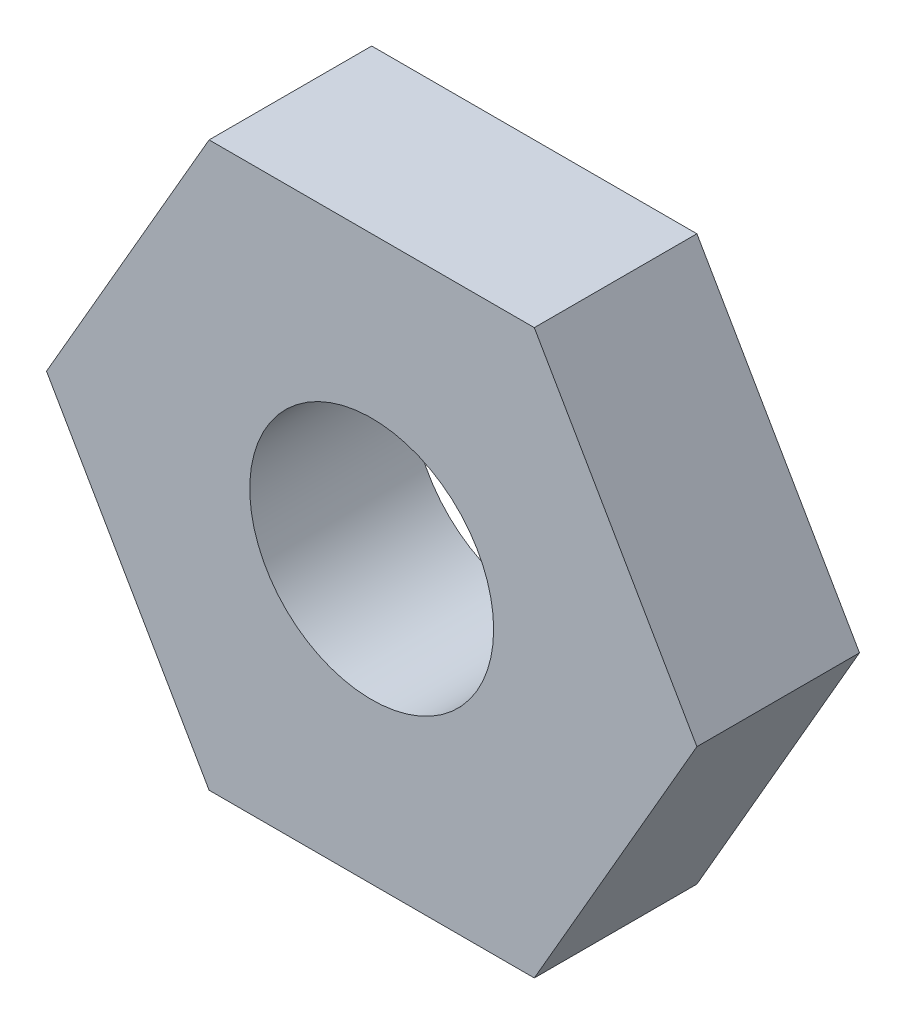
ISO-10303-21;
HEADER;
FILE_DESCRIPTION(('STEP AP214'),'2;1');
FILE_NAME('part.step','',(''),(''),'','','');
FILE_SCHEMA(('AUTOMOTIVE_DESIGN { 1 0 10303 214 1 1 1 1 }'));
ENDSEC;
DATA;
#1=APPLICATION_CONTEXT('core data for automotive mechanical design processes');
#2=APPLICATION_PROTOCOL_DEFINITION('international standard','automotive_design',2000,#1);
#3=PRODUCT_CONTEXT('',#1,'mechanical');
#4=PRODUCT('Part','Part','',(#3));
#5=PRODUCT_RELATED_PRODUCT_CATEGORY('part','',(#4));
#6=PRODUCT_DEFINITION_FORMATION('','',#4);
#7=PRODUCT_DEFINITION_CONTEXT('part definition',#1,'design');
#8=PRODUCT_DEFINITION('design','',#6,#7);
#9=PRODUCT_DEFINITION_SHAPE('','',#8);
#10=(LENGTH_UNIT() NAMED_UNIT(*) SI_UNIT(.MILLI.,.METRE.));
#11=(NAMED_UNIT(*) PLANE_ANGLE_UNIT() SI_UNIT($,.RADIAN.));
#12=(NAMED_UNIT(*) SI_UNIT($,.STERADIAN.) SOLID_ANGLE_UNIT());
#13=UNCERTAINTY_MEASURE_WITH_UNIT(LENGTH_MEASURE(1.E-05),#10,'distance_accuracy_value','');
#14=(GEOMETRIC_REPRESENTATION_CONTEXT(3) GLOBAL_UNCERTAINTY_ASSIGNED_CONTEXT((#13)) GLOBAL_UNIT_ASSIGNED_CONTEXT((#10,
#11,#12)) REPRESENTATION_CONTEXT('',''));
#15=CARTESIAN_POINT('',(0.,0.,0.));
#16=DIRECTION('',(0.,0.,1.));
#17=DIRECTION('',(1.,0.,0.));
#18=AXIS2_PLACEMENT_3D('',#15,#16,#17);
#19=CARTESIAN_POINT('',(0.,0.,2.));
#20=DIRECTION('',(0.,0.,-1.));
#21=DIRECTION('',(-1.,0.,0.));
#22=AXIS2_PLACEMENT_3D('',#19,#20,#21);
#23=PLANE('',#22);
#24=DIRECTION('',(0.499999942468329,-0.866025437000362,0.));
#25=VECTOR('',#24,1.);
#26=CARTESIAN_POINT('',(-2.00000023012667,-3.46410174800146,2.));
#27=LINE('',#26,#25);
#28=CARTESIAN_POINT('',(-3.99999999999999,0.,2.));
#29=VERTEX_POINT('',#28);
#30=CARTESIAN_POINT('',(-2.00000023012667,-3.46410174800146,2.));
#31=VERTEX_POINT('',#30);
#32=EDGE_CURVE('E129',#29,#31,#27,.T.);
#33=ORIENTED_EDGE('',*,*,#32,.T.);
#34=DIRECTION('',(1.,0.,0.));
#35=VECTOR('',#34,1.);
#36=CARTESIAN_POINT('',(1.99999992329111,-3.46410174800146,2.));
#37=LINE('',#36,#35);
#38=CARTESIAN_POINT('',(1.99999992329111,-3.46410174800146,2.));
#39=VERTEX_POINT('',#38);
#40=EDGE_CURVE('E87',#31,#39,#37,.T.);
#41=ORIENTED_EDGE('',*,*,#40,.T.);
#42=DIRECTION('',(0.499999999999998,0.86602540378444,0.));
#43=VECTOR('',#42,1.);
#44=CARTESIAN_POINT('',(3.99999999999999,0.,2.));
#45=LINE('',#44,#43);
#46=CARTESIAN_POINT('',(3.99999999999999,0.,2.));
#47=VERTEX_POINT('',#46);
#48=EDGE_CURVE('E100',#39,#47,#45,.T.);
#49=ORIENTED_EDGE('',*,*,#48,.T.);
#50=DIRECTION('',(-0.499999999999998,0.86602540378444,0.));
#51=VECTOR('',#50,1.);
#52=CARTESIAN_POINT('',(2.,3.46410161513776,2.));
#53=LINE('',#52,#51);
#54=CARTESIAN_POINT('',(2.,3.46410161513776,2.));
#55=VERTEX_POINT('',#54);
#56=EDGE_CURVE('E94',#47,#55,#53,.T.);
#57=ORIENTED_EDGE('',*,*,#56,.T.);
#58=DIRECTION('',(-1.,0.,0.));
#59=VECTOR('',#58,1.);
#60=CARTESIAN_POINT('',(-2.,3.46410161513776,2.));
#61=LINE('',#60,#59);
#62=CARTESIAN_POINT('',(-2.,3.46410161513776,2.));
#63=VERTEX_POINT('',#62);
#64=EDGE_CURVE('E98',#55,#63,#61,.T.);
#65=ORIENTED_EDGE('',*,*,#64,.T.);
#66=DIRECTION('',(-0.499999999999998,-0.86602540378444,0.));
#67=VECTOR('',#66,1.);
#68=CARTESIAN_POINT('',(-3.99999999999999,0.,2.));
#69=LINE('',#68,#67);
#70=EDGE_CURVE('E50',#63,#29,#69,.T.);
#71=ORIENTED_EDGE('',*,*,#70,.T.);
#72=EDGE_LOOP('',(#33,#41,#49,#57,#65,#71));
#73=FACE_BOUND('',#72,.T.);
#74=CARTESIAN_POINT('',(0.,0.,2.));
#75=DIRECTION('',(0.,0.,1.));
#76=DIRECTION('',(1.,0.,0.));
#77=AXIS2_PLACEMENT_3D('',#74,#75,#76);
#78=CIRCLE('',#77,1.5);
#79=CARTESIAN_POINT('',(1.5,0.,2.));
#80=VERTEX_POINT('',#79);
#81=EDGE_CURVE('E122',#80,#80,#78,.T.);
#82=ORIENTED_EDGE('',*,*,#81,.F.);
#83=EDGE_LOOP('',(#82));
#84=FACE_BOUND('',#83,.T.);
#85=ADVANCED_FACE('F33',(#73,#84),#23,.F.);
#86=CARTESIAN_POINT('',(0.,0.,0.));
#87=DIRECTION('',(0.,0.,-1.));
#88=DIRECTION('',(-1.,0.,0.));
#89=AXIS2_PLACEMENT_3D('',#86,#87,#88);
#90=PLANE('',#89);
#91=DIRECTION('',(0.499999942468329,-0.866025437000362,0.));
#92=VECTOR('',#91,1.);
#93=CARTESIAN_POINT('',(-2.00000023012667,-3.46410174800146,0.));
#94=LINE('',#93,#92);
#95=CARTESIAN_POINT('',(-3.99999999999999,0.,0.));
#96=VERTEX_POINT('',#95);
#97=CARTESIAN_POINT('',(-2.00000023012667,-3.46410174800146,0.));
#98=VERTEX_POINT('',#97);
#99=EDGE_CURVE('E118',#96,#98,#94,.T.);
#100=ORIENTED_EDGE('',*,*,#99,.F.);
#101=DIRECTION('',(-0.499999999999998,-0.86602540378444,0.));
#102=VECTOR('',#101,1.);
#103=CARTESIAN_POINT('',(-3.99999999999999,0.,0.));
#104=LINE('',#103,#102);
#105=CARTESIAN_POINT('',(-2.,3.46410161513776,0.));
#106=VERTEX_POINT('',#105);
#107=EDGE_CURVE('E79',#106,#96,#104,.T.);
#108=ORIENTED_EDGE('',*,*,#107,.F.);
#109=DIRECTION('',(-1.,0.,0.));
#110=VECTOR('',#109,1.);
#111=CARTESIAN_POINT('',(-2.,3.46410161513776,0.));
#112=LINE('',#111,#110);
#113=CARTESIAN_POINT('',(2.,3.46410161513776,0.));
#114=VERTEX_POINT('',#113);
#115=EDGE_CURVE('E73',#114,#106,#112,.T.);
#116=ORIENTED_EDGE('',*,*,#115,.F.);
#117=DIRECTION('',(-0.499999999999998,0.86602540378444,0.));
#118=VECTOR('',#117,1.);
#119=CARTESIAN_POINT('',(2.,3.46410161513776,0.));
#120=LINE('',#119,#118);
#121=CARTESIAN_POINT('',(3.99999999999999,0.,0.));
#122=VERTEX_POINT('',#121);
#123=EDGE_CURVE('E108',#122,#114,#120,.T.);
#124=ORIENTED_EDGE('',*,*,#123,.F.);
#125=DIRECTION('',(0.499999999999998,0.86602540378444,0.));
#126=VECTOR('',#125,1.);
#127=CARTESIAN_POINT('',(3.99999999999999,0.,0.));
#128=LINE('',#127,#126);
#129=CARTESIAN_POINT('',(1.99999992329111,-3.46410174800146,0.));
#130=VERTEX_POINT('',#129);
#131=EDGE_CURVE('E124',#130,#122,#128,.T.);
#132=ORIENTED_EDGE('',*,*,#131,.F.);
#133=DIRECTION('',(1.,0.,0.));
#134=VECTOR('',#133,1.);
#135=CARTESIAN_POINT('',(1.99999992329111,-3.46410174800146,0.));
#136=LINE('',#135,#134);
#137=EDGE_CURVE('E121',#98,#130,#136,.T.);
#138=ORIENTED_EDGE('',*,*,#137,.F.);
#139=EDGE_LOOP('',(#100,#108,#116,#124,#132,#138));
#140=FACE_BOUND('',#139,.T.);
#141=CARTESIAN_POINT('',(0.,0.,0.));
#142=DIRECTION('',(0.,0.,1.));
#143=DIRECTION('',(1.,0.,0.));
#144=AXIS2_PLACEMENT_3D('',#141,#142,#143);
#145=CIRCLE('',#144,1.5);
#146=CARTESIAN_POINT('',(1.5,0.,0.));
#147=VERTEX_POINT('',#146);
#148=EDGE_CURVE('E222',#147,#147,#145,.T.);
#149=ORIENTED_EDGE('',*,*,#148,.T.);
#150=EDGE_LOOP('',(#149));
#151=FACE_BOUND('',#150,.T.);
#152=ADVANCED_FACE('F138',(#140,#151),#90,.T.);
#153=CARTESIAN_POINT('',(-2.00000023012667,-3.46410174800146,2.));
#154=DIRECTION('',(0.866025437000362,0.499999942468329,0.));
#155=DIRECTION('',(-0.499999942468329,0.866025437000362,0.));
#156=AXIS2_PLACEMENT_3D('',#153,#154,#155);
#157=PLANE('',#156);
#158=ORIENTED_EDGE('',*,*,#99,.T.);
#159=DIRECTION('',(0.,0.,-1.));
#160=VECTOR('',#159,1.);
#161=CARTESIAN_POINT('',(-2.00000023012667,-3.46410174800146,2.));
#162=LINE('',#161,#160);
#163=EDGE_CURVE('E11',#31,#98,#162,.T.);
#164=ORIENTED_EDGE('',*,*,#163,.F.);
#165=ORIENTED_EDGE('',*,*,#32,.F.);
#166=DIRECTION('',(0.,0.,-1.));
#167=VECTOR('',#166,1.);
#168=CARTESIAN_POINT('',(-3.99999999999999,0.,2.));
#169=LINE('',#168,#167);
#170=EDGE_CURVE('E114',#29,#96,#169,.T.);
#171=ORIENTED_EDGE('',*,*,#170,.T.);
#172=EDGE_LOOP('',(#158,#164,#165,#171));
#173=FACE_BOUND('',#172,.T.);
#174=ADVANCED_FACE('F35',(#173),#157,.F.);
#175=CARTESIAN_POINT('',(1.99999992329111,-3.46410174800146,2.));
#176=DIRECTION('',(0.,1.,0.));
#177=DIRECTION('',(0.,0.,1.));
#178=AXIS2_PLACEMENT_3D('',#175,#176,#177);
#179=PLANE('',#178);
#180=ORIENTED_EDGE('',*,*,#137,.T.);
#181=DIRECTION('',(0.,0.,-1.));
#182=VECTOR('',#181,1.);
#183=CARTESIAN_POINT('',(1.99999992329111,-3.46410174800146,2.));
#184=LINE('',#183,#182);
#185=EDGE_CURVE('E42',#39,#130,#184,.T.);
#186=ORIENTED_EDGE('',*,*,#185,.F.);
#187=ORIENTED_EDGE('',*,*,#40,.F.);
#188=ORIENTED_EDGE('',*,*,#163,.T.);
#189=EDGE_LOOP('',(#180,#186,#187,#188));
#190=FACE_BOUND('',#189,.T.);
#191=ADVANCED_FACE('F163',(#190),#179,.F.);
#192=CARTESIAN_POINT('',(3.99999999999999,0.,2.));
#193=DIRECTION('',(-0.86602540378444,0.499999999999998,0.));
#194=DIRECTION('',(-0.499999999999998,-0.86602540378444,0.));
#195=AXIS2_PLACEMENT_3D('',#192,#193,#194);
#196=PLANE('',#195);
#197=ORIENTED_EDGE('',*,*,#131,.T.);
#198=DIRECTION('',(0.,0.,-1.));
#199=VECTOR('',#198,1.);
#200=CARTESIAN_POINT('',(3.99999999999999,0.,2.));
#201=LINE('',#200,#199);
#202=EDGE_CURVE('E109',#47,#122,#201,.T.);
#203=ORIENTED_EDGE('',*,*,#202,.F.);
#204=ORIENTED_EDGE('',*,*,#48,.F.);
#205=ORIENTED_EDGE('',*,*,#185,.T.);
#206=EDGE_LOOP('',(#197,#203,#204,#205));
#207=FACE_BOUND('',#206,.T.);
#208=ADVANCED_FACE('F135',(#207),#196,.F.);
#209=CARTESIAN_POINT('',(2.,3.46410161513776,2.));
#210=DIRECTION('',(-0.86602540378444,-0.499999999999998,0.));
#211=DIRECTION('',(0.499999999999998,-0.86602540378444,0.));
#212=AXIS2_PLACEMENT_3D('',#209,#210,#211);
#213=PLANE('',#212);
#214=ORIENTED_EDGE('',*,*,#123,.T.);
#215=DIRECTION('',(0.,0.,-1.));
#216=VECTOR('',#215,1.);
#217=CARTESIAN_POINT('',(2.,3.46410161513776,2.));
#218=LINE('',#217,#216);
#219=EDGE_CURVE('E105',#55,#114,#218,.T.);
#220=ORIENTED_EDGE('',*,*,#219,.F.);
#221=ORIENTED_EDGE('',*,*,#56,.F.);
#222=ORIENTED_EDGE('',*,*,#202,.T.);
#223=EDGE_LOOP('',(#214,#220,#221,#222));
#224=FACE_BOUND('',#223,.T.);
#225=ADVANCED_FACE('F106',(#224),#213,.F.);
#226=CARTESIAN_POINT('',(-2.,3.46410161513776,2.));
#227=DIRECTION('',(0.,-1.,0.));
#228=DIRECTION('',(0.,0.,-1.));
#229=AXIS2_PLACEMENT_3D('',#226,#227,#228);
#230=PLANE('',#229);
#231=ORIENTED_EDGE('',*,*,#115,.T.);
#232=DIRECTION('',(0.,0.,-1.));
#233=VECTOR('',#232,1.);
#234=CARTESIAN_POINT('',(-2.,3.46410161513776,2.));
#235=LINE('',#234,#233);
#236=EDGE_CURVE('E110',#63,#106,#235,.T.);
#237=ORIENTED_EDGE('',*,*,#236,.F.);
#238=ORIENTED_EDGE('',*,*,#64,.F.);
#239=ORIENTED_EDGE('',*,*,#219,.T.);
#240=EDGE_LOOP('',(#231,#237,#238,#239));
#241=FACE_BOUND('',#240,.T.);
#242=ADVANCED_FACE('F112',(#241),#230,.F.);
#243=CARTESIAN_POINT('',(-3.99999999999999,0.,2.));
#244=DIRECTION('',(0.86602540378444,-0.499999999999998,0.));
#245=DIRECTION('',(0.499999999999998,0.86602540378444,0.));
#246=AXIS2_PLACEMENT_3D('',#243,#244,#245);
#247=PLANE('',#246);
#248=ORIENTED_EDGE('',*,*,#107,.T.);
#249=ORIENTED_EDGE('',*,*,#170,.F.);
#250=ORIENTED_EDGE('',*,*,#70,.F.);
#251=ORIENTED_EDGE('',*,*,#236,.T.);
#252=EDGE_LOOP('',(#248,#249,#250,#251));
#253=FACE_BOUND('',#252,.T.);
#254=ADVANCED_FACE('F143',(#253),#247,.F.);
#255=CARTESIAN_POINT('',(0.,0.,2.));
#256=DIRECTION('',(0.,0.,-1.));
#257=DIRECTION('',(-1.,0.,0.));
#258=AXIS2_PLACEMENT_3D('',#255,#256,#257);
#259=CYLINDRICAL_SURFACE('',#258,1.5);
#260=ORIENTED_EDGE('',*,*,#81,.T.);
#261=EDGE_LOOP('',(#260));
#262=FACE_BOUND('',#261,.T.);
#263=ORIENTED_EDGE('',*,*,#148,.F.);
#264=EDGE_LOOP('',(#263));
#265=FACE_BOUND('',#264,.T.);
#266=ADVANCED_FACE('F145',(#262,#265),#259,.F.);
#267=CLOSED_SHELL('',(#85,#152,#174,#191,#208,#225,#242,#254,#266));
#268=MANIFOLD_SOLID_BREP('B2',#267);
#269=ADVANCED_BREP_SHAPE_REPRESENTATION('',(#18,#268),#14);
#270=SHAPE_DEFINITION_REPRESENTATION(#9,#269);
ENDSEC;
END-ISO-10303-21;
